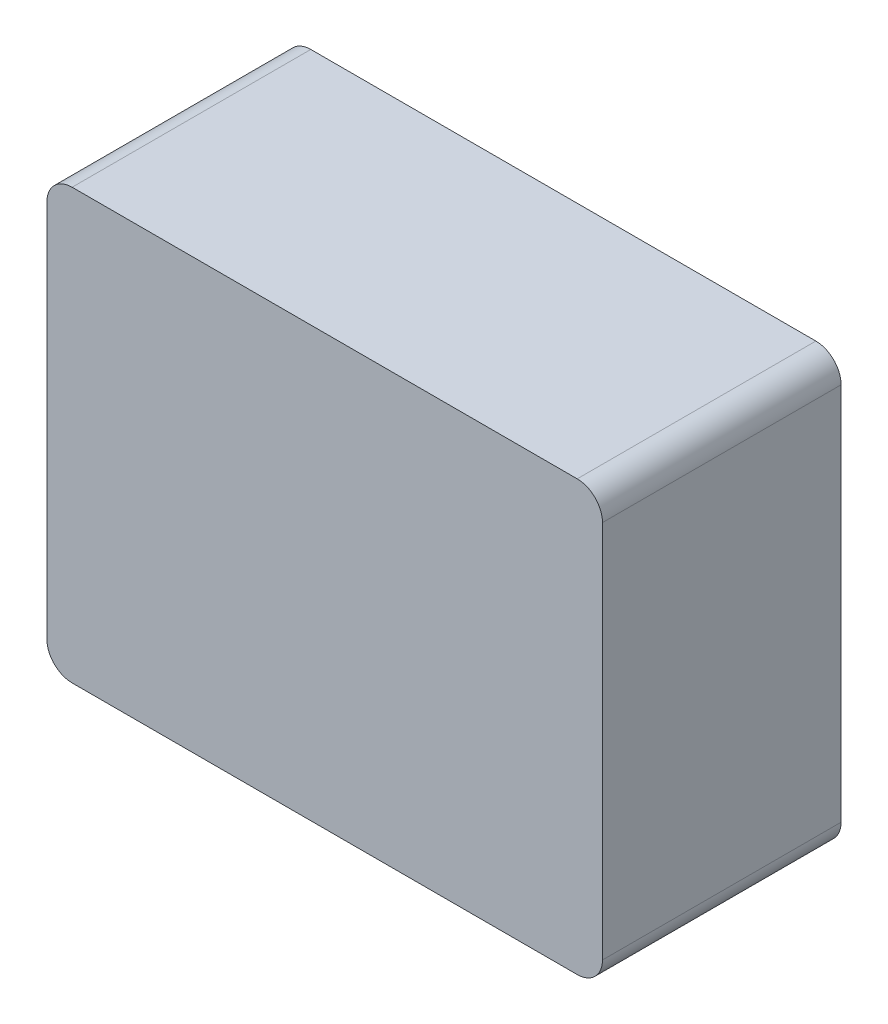
ISO-10303-21;
HEADER;
FILE_DESCRIPTION(('STEP AP214'),'2;1');
FILE_NAME('part.step','',(''),(''),'','','');
FILE_SCHEMA(('AUTOMOTIVE_DESIGN { 1 0 10303 214 1 1 1 1 }'));
ENDSEC;
DATA;
#1=APPLICATION_CONTEXT('core data for automotive mechanical design processes');
#2=APPLICATION_PROTOCOL_DEFINITION('international standard','automotive_design',2000,#1);
#3=PRODUCT_CONTEXT('',#1,'mechanical');
#4=PRODUCT('Part','Part','',(#3));
#5=PRODUCT_RELATED_PRODUCT_CATEGORY('part','',(#4));
#6=PRODUCT_DEFINITION_FORMATION('','',#4);
#7=PRODUCT_DEFINITION_CONTEXT('part definition',#1,'design');
#8=PRODUCT_DEFINITION('design','',#6,#7);
#9=PRODUCT_DEFINITION_SHAPE('','',#8);
#10=(LENGTH_UNIT() NAMED_UNIT(*) SI_UNIT(.MILLI.,.METRE.));
#11=(NAMED_UNIT(*) PLANE_ANGLE_UNIT() SI_UNIT($,.RADIAN.));
#12=(NAMED_UNIT(*) SI_UNIT($,.STERADIAN.) SOLID_ANGLE_UNIT());
#13=UNCERTAINTY_MEASURE_WITH_UNIT(LENGTH_MEASURE(1.E-05),#10,'distance_accuracy_value','');
#14=(GEOMETRIC_REPRESENTATION_CONTEXT(3) GLOBAL_UNCERTAINTY_ASSIGNED_CONTEXT((#13)) GLOBAL_UNIT_ASSIGNED_CONTEXT((#10,
#11,#12)) REPRESENTATION_CONTEXT('',''));
#15=CARTESIAN_POINT('',(0.,0.,0.));
#16=DIRECTION('',(0.,0.,1.));
#17=DIRECTION('',(1.,0.,0.));
#18=AXIS2_PLACEMENT_3D('',#15,#16,#17);
#19=CARTESIAN_POINT('',(0.,34.,0.));
#20=DIRECTION('',(-1.,0.,0.));
#21=DIRECTION('',(0.,0.,1.));
#22=AXIS2_PLACEMENT_3D('',#19,#20,#21);
#23=PLANE('',#22);
#24=DIRECTION('',(0.,-1.,0.));
#25=VECTOR('',#24,1.);
#26=CARTESIAN_POINT('',(0.,34.,-18.9));
#27=LINE('',#26,#25);
#28=CARTESIAN_POINT('',(0.,32.,-18.9));
#29=VERTEX_POINT('',#28);
#30=CARTESIAN_POINT('',(0.,2.,-18.9));
#31=VERTEX_POINT('',#30);
#32=EDGE_CURVE('E143',#29,#31,#27,.T.);
#33=ORIENTED_EDGE('',*,*,#32,.T.);
#34=DIRECTION('',(0.,0.,-1.));
#35=VECTOR('',#34,1.);
#36=CARTESIAN_POINT('',(0.,2.,0.));
#37=LINE('',#36,#35);
#38=CARTESIAN_POINT('',(0.,2.,0.));
#39=VERTEX_POINT('',#38);
#40=EDGE_CURVE('E103',#31,#39,#37,.F.);
#41=ORIENTED_EDGE('',*,*,#40,.T.);
#42=DIRECTION('',(0.,-1.,0.));
#43=VECTOR('',#42,1.);
#44=CARTESIAN_POINT('',(0.,34.,0.));
#45=LINE('',#44,#43);
#46=CARTESIAN_POINT('',(0.,32.,0.));
#47=VERTEX_POINT('',#46);
#48=EDGE_CURVE('E135',#47,#39,#45,.T.);
#49=ORIENTED_EDGE('',*,*,#48,.F.);
#50=DIRECTION('',(0.,0.,-1.));
#51=VECTOR('',#50,1.);
#52=CARTESIAN_POINT('',(0.,32.,-18.9));
#53=LINE('',#52,#51);
#54=EDGE_CURVE('E108',#47,#29,#53,.T.);
#55=ORIENTED_EDGE('',*,*,#54,.T.);
#56=EDGE_LOOP('',(#33,#41,#49,#55));
#57=FACE_BOUND('',#56,.T.);
#58=ADVANCED_FACE('F32',(#57),#23,.T.);
#59=CARTESIAN_POINT('',(0.,34.,0.));
#60=DIRECTION('',(0.,0.,-1.));
#61=DIRECTION('',(-1.,0.,0.));
#62=AXIS2_PLACEMENT_3D('',#59,#60,#61);
#63=PLANE('',#62);
#64=ORIENTED_EDGE('',*,*,#48,.T.);
#65=CARTESIAN_POINT('',(2.,2.,0.));
#66=DIRECTION('',(0.,0.,-1.));
#67=DIRECTION('',(-1.,0.,0.));
#68=AXIS2_PLACEMENT_3D('',#65,#66,#67);
#69=CIRCLE('',#68,2.);
#70=CARTESIAN_POINT('',(2.,0.,0.));
#71=VERTEX_POINT('',#70);
#72=EDGE_CURVE('E158',#39,#71,#69,.F.);
#73=ORIENTED_EDGE('',*,*,#72,.T.);
#74=DIRECTION('',(1.,0.,0.));
#75=VECTOR('',#74,1.);
#76=CARTESIAN_POINT('',(0.,0.,0.));
#77=LINE('',#76,#75);
#78=CARTESIAN_POINT('',(42.,0.,0.));
#79=VERTEX_POINT('',#78);
#80=EDGE_CURVE('E118',#71,#79,#77,.T.);
#81=ORIENTED_EDGE('',*,*,#80,.T.);
#82=CARTESIAN_POINT('',(42.,2.,0.));
#83=DIRECTION('',(0.,0.,-1.));
#84=DIRECTION('',(-1.,0.,0.));
#85=AXIS2_PLACEMENT_3D('',#82,#83,#84);
#86=CIRCLE('',#85,2.);
#87=CARTESIAN_POINT('',(44.,2.,0.));
#88=VERTEX_POINT('',#87);
#89=EDGE_CURVE('E156',#79,#88,#86,.F.);
#90=ORIENTED_EDGE('',*,*,#89,.T.);
#91=DIRECTION('',(0.,-1.,0.));
#92=VECTOR('',#91,1.);
#93=CARTESIAN_POINT('',(44.,34.,0.));
#94=LINE('',#93,#92);
#95=CARTESIAN_POINT('',(44.,32.,0.));
#96=VERTEX_POINT('',#95);
#97=EDGE_CURVE('E138',#96,#88,#94,.T.);
#98=ORIENTED_EDGE('',*,*,#97,.F.);
#99=CARTESIAN_POINT('',(42.,32.,0.));
#100=DIRECTION('',(0.,0.,-1.));
#101=DIRECTION('',(-1.,0.,0.));
#102=AXIS2_PLACEMENT_3D('',#99,#100,#101);
#103=CIRCLE('',#102,2.);
#104=CARTESIAN_POINT('',(42.,34.,0.));
#105=VERTEX_POINT('',#104);
#106=EDGE_CURVE('E47',#96,#105,#103,.F.);
#107=ORIENTED_EDGE('',*,*,#106,.T.);
#108=DIRECTION('',(1.,0.,0.));
#109=VECTOR('',#108,1.);
#110=CARTESIAN_POINT('',(0.,34.,0.));
#111=LINE('',#110,#109);
#112=CARTESIAN_POINT('',(2.,34.,0.));
#113=VERTEX_POINT('',#112);
#114=EDGE_CURVE('E132',#113,#105,#111,.T.);
#115=ORIENTED_EDGE('',*,*,#114,.F.);
#116=CARTESIAN_POINT('',(2.,32.,0.));
#117=DIRECTION('',(0.,0.,-1.));
#118=DIRECTION('',(-1.,0.,0.));
#119=AXIS2_PLACEMENT_3D('',#116,#117,#118);
#120=CIRCLE('',#119,2.);
#121=EDGE_CURVE('E153',#113,#47,#120,.F.);
#122=ORIENTED_EDGE('',*,*,#121,.T.);
#123=EDGE_LOOP('',(#64,#73,#81,#90,#98,#107,#115,#122));
#124=FACE_BOUND('',#123,.T.);
#125=ADVANCED_FACE('F233',(#124),#63,.F.);
#126=CARTESIAN_POINT('',(44.,34.,0.));
#127=DIRECTION('',(-1.,0.,0.));
#128=DIRECTION('',(0.,0.,1.));
#129=AXIS2_PLACEMENT_3D('',#126,#127,#128);
#130=PLANE('',#129);
#131=ORIENTED_EDGE('',*,*,#97,.T.);
#132=DIRECTION('',(0.,0.,-1.));
#133=VECTOR('',#132,1.);
#134=CARTESIAN_POINT('',(44.,2.,-18.9));
#135=LINE('',#134,#133);
#136=CARTESIAN_POINT('',(44.,2.,-18.9));
#137=VERTEX_POINT('',#136);
#138=EDGE_CURVE('E162',#88,#137,#135,.T.);
#139=ORIENTED_EDGE('',*,*,#138,.T.);
#140=DIRECTION('',(0.,-1.,0.));
#141=VECTOR('',#140,1.);
#142=CARTESIAN_POINT('',(44.,34.,-18.9));
#143=LINE('',#142,#141);
#144=CARTESIAN_POINT('',(44.,32.,-18.9));
#145=VERTEX_POINT('',#144);
#146=EDGE_CURVE('E141',#145,#137,#143,.T.);
#147=ORIENTED_EDGE('',*,*,#146,.F.);
#148=DIRECTION('',(0.,0.,-1.));
#149=VECTOR('',#148,1.);
#150=CARTESIAN_POINT('',(44.,32.,0.));
#151=LINE('',#150,#149);
#152=EDGE_CURVE('E160',#145,#96,#151,.F.);
#153=ORIENTED_EDGE('',*,*,#152,.T.);
#154=EDGE_LOOP('',(#131,#139,#147,#153));
#155=FACE_BOUND('',#154,.T.);
#156=ADVANCED_FACE('F167',(#155),#130,.F.);
#157=CARTESIAN_POINT('',(0.,34.,-18.9));
#158=DIRECTION('',(0.,0.,-1.));
#159=DIRECTION('',(-1.,0.,0.));
#160=AXIS2_PLACEMENT_3D('',#157,#158,#159);
#161=PLANE('',#160);
#162=DIRECTION('',(1.,0.,0.));
#163=VECTOR('',#162,1.);
#164=CARTESIAN_POINT('',(0.,0.,-18.9));
#165=LINE('',#164,#163);
#166=CARTESIAN_POINT('',(2.,0.,-18.9));
#167=VERTEX_POINT('',#166);
#168=CARTESIAN_POINT('',(42.,0.,-18.9));
#169=VERTEX_POINT('',#168);
#170=EDGE_CURVE('E115',#167,#169,#165,.T.);
#171=ORIENTED_EDGE('',*,*,#170,.F.);
#172=CARTESIAN_POINT('',(2.,2.,-18.9));
#173=DIRECTION('',(0.,0.,-1.));
#174=DIRECTION('',(-1.,0.,0.));
#175=AXIS2_PLACEMENT_3D('',#172,#173,#174);
#176=CIRCLE('',#175,2.);
#177=EDGE_CURVE('E98',#167,#31,#176,.T.);
#178=ORIENTED_EDGE('',*,*,#177,.T.);
#179=ORIENTED_EDGE('',*,*,#32,.F.);
#180=CARTESIAN_POINT('',(2.,32.,-18.9));
#181=DIRECTION('',(0.,0.,-1.));
#182=DIRECTION('',(-1.,0.,0.));
#183=AXIS2_PLACEMENT_3D('',#180,#181,#182);
#184=CIRCLE('',#183,2.);
#185=CARTESIAN_POINT('',(2.,34.,-18.9));
#186=VERTEX_POINT('',#185);
#187=EDGE_CURVE('E119',#29,#186,#184,.T.);
#188=ORIENTED_EDGE('',*,*,#187,.T.);
#189=DIRECTION('',(1.,0.,0.));
#190=VECTOR('',#189,1.);
#191=CARTESIAN_POINT('',(0.,34.,-18.9));
#192=LINE('',#191,#190);
#193=CARTESIAN_POINT('',(42.,34.,-18.9));
#194=VERTEX_POINT('',#193);
#195=EDGE_CURVE('E126',#186,#194,#192,.T.);
#196=ORIENTED_EDGE('',*,*,#195,.T.);
#197=CARTESIAN_POINT('',(42.,32.,-18.9));
#198=DIRECTION('',(0.,0.,-1.));
#199=DIRECTION('',(-1.,0.,0.));
#200=AXIS2_PLACEMENT_3D('',#197,#198,#199);
#201=CIRCLE('',#200,2.);
#202=EDGE_CURVE('E147',#194,#145,#201,.T.);
#203=ORIENTED_EDGE('',*,*,#202,.T.);
#204=ORIENTED_EDGE('',*,*,#146,.T.);
#205=CARTESIAN_POINT('',(42.,2.,-18.9));
#206=DIRECTION('',(0.,0.,-1.));
#207=DIRECTION('',(-1.,0.,0.));
#208=AXIS2_PLACEMENT_3D('',#205,#206,#207);
#209=CIRCLE('',#208,2.);
#210=EDGE_CURVE('E109',#137,#169,#209,.T.);
#211=ORIENTED_EDGE('',*,*,#210,.T.);
#212=EDGE_LOOP('',(#171,#178,#179,#188,#196,#203,#204,#211));
#213=FACE_BOUND('',#212,.T.);
#214=ADVANCED_FACE('F122',(#213),#161,.T.);
#215=CARTESIAN_POINT('',(0.,34.,0.));
#216=DIRECTION('',(0.,-1.,0.));
#217=DIRECTION('',(0.,0.,-1.));
#218=AXIS2_PLACEMENT_3D('',#215,#216,#217);
#219=PLANE('',#218);
#220=ORIENTED_EDGE('',*,*,#114,.T.);
#221=DIRECTION('',(0.,0.,-1.));
#222=VECTOR('',#221,1.);
#223=CARTESIAN_POINT('',(42.,34.,0.));
#224=LINE('',#223,#222);
#225=EDGE_CURVE('E11',#105,#194,#224,.T.);
#226=ORIENTED_EDGE('',*,*,#225,.T.);
#227=ORIENTED_EDGE('',*,*,#195,.F.);
#228=DIRECTION('',(0.,0.,-1.));
#229=VECTOR('',#228,1.);
#230=CARTESIAN_POINT('',(2.,34.,0.));
#231=LINE('',#230,#229);
#232=EDGE_CURVE('E40',#186,#113,#231,.F.);
#233=ORIENTED_EDGE('',*,*,#232,.T.);
#234=EDGE_LOOP('',(#220,#226,#227,#233));
#235=FACE_BOUND('',#234,.T.);
#236=ADVANCED_FACE('F175',(#235),#219,.F.);
#237=CARTESIAN_POINT('',(0.,0.,0.));
#238=DIRECTION('',(0.,-1.,0.));
#239=DIRECTION('',(0.,0.,-1.));
#240=AXIS2_PLACEMENT_3D('',#237,#238,#239);
#241=PLANE('',#240);
#242=CARTESIAN_POINT('',(33.,0.,-15.02));
#243=DIRECTION('',(0.,-1.,0.));
#244=DIRECTION('',(0.,0.,-1.));
#245=AXIS2_PLACEMENT_3D('',#242,#243,#244);
#246=CIRCLE('',#245,0.999999999999998);
#247=CARTESIAN_POINT('',(33.,0.,-16.02));
#248=VERTEX_POINT('',#247);
#249=EDGE_CURVE('E193',#248,#248,#246,.T.);
#250=ORIENTED_EDGE('',*,*,#249,.F.);
#251=EDGE_LOOP('',(#250));
#252=FACE_BOUND('',#251,.T.);
#253=CARTESIAN_POINT('',(11.,0.,-15.02));
#254=DIRECTION('',(0.,-1.,0.));
#255=DIRECTION('',(0.,0.,-1.));
#256=AXIS2_PLACEMENT_3D('',#253,#254,#255);
#257=CIRCLE('',#256,1.);
#258=CARTESIAN_POINT('',(11.,0.,-16.02));
#259=VERTEX_POINT('',#258);
#260=EDGE_CURVE('E187',#259,#259,#257,.T.);
#261=ORIENTED_EDGE('',*,*,#260,.F.);
#262=EDGE_LOOP('',(#261));
#263=FACE_BOUND('',#262,.T.);
#264=CARTESIAN_POINT('',(33.,0.,-3.02000000000002));
#265=DIRECTION('',(0.,-1.,0.));
#266=DIRECTION('',(0.,0.,-1.));
#267=AXIS2_PLACEMENT_3D('',#264,#265,#266);
#268=CIRCLE('',#267,0.999999999999998);
#269=CARTESIAN_POINT('',(33.,0.,-4.02000000000002));
#270=VERTEX_POINT('',#269);
#271=EDGE_CURVE('E181',#270,#270,#268,.T.);
#272=ORIENTED_EDGE('',*,*,#271,.F.);
#273=EDGE_LOOP('',(#272));
#274=FACE_BOUND('',#273,.T.);
#275=CARTESIAN_POINT('',(11.,0.,-3.02000000000003));
#276=DIRECTION('',(0.,-1.,0.));
#277=DIRECTION('',(0.,0.,-1.));
#278=AXIS2_PLACEMENT_3D('',#275,#276,#277);
#279=CIRCLE('',#278,1.);
#280=CARTESIAN_POINT('',(11.,0.,-4.02000000000003));
#281=VERTEX_POINT('',#280);
#282=EDGE_CURVE('E129',#281,#281,#279,.T.);
#283=ORIENTED_EDGE('',*,*,#282,.F.);
#284=EDGE_LOOP('',(#283));
#285=FACE_BOUND('',#284,.T.);
#286=ORIENTED_EDGE('',*,*,#80,.F.);
#287=DIRECTION('',(0.,0.,-1.));
#288=VECTOR('',#287,1.);
#289=CARTESIAN_POINT('',(2.,0.,0.));
#290=LINE('',#289,#288);
#291=EDGE_CURVE('E102',#71,#167,#290,.T.);
#292=ORIENTED_EDGE('',*,*,#291,.T.);
#293=ORIENTED_EDGE('',*,*,#170,.T.);
#294=DIRECTION('',(0.,0.,-1.));
#295=VECTOR('',#294,1.);
#296=CARTESIAN_POINT('',(42.,0.,0.));
#297=LINE('',#296,#295);
#298=EDGE_CURVE('E120',#169,#79,#297,.F.);
#299=ORIENTED_EDGE('',*,*,#298,.T.);
#300=EDGE_LOOP('',(#286,#292,#293,#299));
#301=FACE_BOUND('',#300,.T.);
#302=ADVANCED_FACE('F114',(#252,#263,#274,#285,#301),#241,.T.);
#303=CARTESIAN_POINT('',(2.,2.,0.));
#304=DIRECTION('',(0.,0.,-1.));
#305=DIRECTION('',(-1.,0.,0.));
#306=AXIS2_PLACEMENT_3D('',#303,#304,#305);
#307=CYLINDRICAL_SURFACE('',#306,2.);
#308=ORIENTED_EDGE('',*,*,#72,.F.);
#309=ORIENTED_EDGE('',*,*,#40,.F.);
#310=ORIENTED_EDGE('',*,*,#177,.F.);
#311=ORIENTED_EDGE('',*,*,#291,.F.);
#312=EDGE_LOOP('',(#308,#309,#310,#311));
#313=FACE_BOUND('',#312,.T.);
#314=ADVANCED_FACE('F101',(#313),#307,.T.);
#315=CARTESIAN_POINT('',(42.,2.,0.));
#316=DIRECTION('',(0.,0.,1.));
#317=DIRECTION('',(1.,0.,0.));
#318=AXIS2_PLACEMENT_3D('',#315,#316,#317);
#319=CYLINDRICAL_SURFACE('',#318,2.);
#320=ORIENTED_EDGE('',*,*,#89,.F.);
#321=ORIENTED_EDGE('',*,*,#298,.F.);
#322=ORIENTED_EDGE('',*,*,#210,.F.);
#323=ORIENTED_EDGE('',*,*,#138,.F.);
#324=EDGE_LOOP('',(#320,#321,#322,#323));
#325=FACE_BOUND('',#324,.T.);
#326=ADVANCED_FACE('F245',(#325),#319,.T.);
#327=CARTESIAN_POINT('',(42.,32.,0.));
#328=DIRECTION('',(0.,0.,-1.));
#329=DIRECTION('',(-1.,0.,0.));
#330=AXIS2_PLACEMENT_3D('',#327,#328,#329);
#331=CYLINDRICAL_SURFACE('',#330,2.);
#332=ORIENTED_EDGE('',*,*,#106,.F.);
#333=ORIENTED_EDGE('',*,*,#152,.F.);
#334=ORIENTED_EDGE('',*,*,#202,.F.);
#335=ORIENTED_EDGE('',*,*,#225,.F.);
#336=EDGE_LOOP('',(#332,#333,#334,#335));
#337=FACE_BOUND('',#336,.T.);
#338=ADVANCED_FACE('F174',(#337),#331,.T.);
#339=CARTESIAN_POINT('',(2.,32.,0.));
#340=DIRECTION('',(0.,0.,1.));
#341=DIRECTION('',(1.,0.,0.));
#342=AXIS2_PLACEMENT_3D('',#339,#340,#341);
#343=CYLINDRICAL_SURFACE('',#342,2.);
#344=ORIENTED_EDGE('',*,*,#121,.F.);
#345=ORIENTED_EDGE('',*,*,#232,.F.);
#346=ORIENTED_EDGE('',*,*,#187,.F.);
#347=ORIENTED_EDGE('',*,*,#54,.F.);
#348=EDGE_LOOP('',(#344,#345,#346,#347));
#349=FACE_BOUND('',#348,.T.);
#350=ADVANCED_FACE('F34',(#349),#343,.T.);
#351=CARTESIAN_POINT('',(11.,3.5,-3.02000000000003));
#352=DIRECTION('',(0.,-1.,0.));
#353=DIRECTION('',(0.,0.,-1.));
#354=AXIS2_PLACEMENT_3D('',#351,#352,#353);
#355=CYLINDRICAL_SURFACE('',#354,1.);
#356=CARTESIAN_POINT('',(11.,3.5,-3.02000000000003));
#357=DIRECTION('',(0.,-1.,0.));
#358=DIRECTION('',(0.,0.,-1.));
#359=AXIS2_PLACEMENT_3D('',#356,#357,#358);
#360=CIRCLE('',#359,1.);
#361=CARTESIAN_POINT('',(11.,3.5,-4.02000000000003));
#362=VERTEX_POINT('',#361);
#363=EDGE_CURVE('E124',#362,#362,#360,.T.);
#364=ORIENTED_EDGE('',*,*,#363,.F.);
#365=EDGE_LOOP('',(#364));
#366=FACE_BOUND('',#365,.T.);
#367=ORIENTED_EDGE('',*,*,#282,.T.);
#368=EDGE_LOOP('',(#367));
#369=FACE_BOUND('',#368,.T.);
#370=ADVANCED_FACE('F217',(#366,#369),#355,.F.);
#371=CARTESIAN_POINT('',(11.,3.5,-3.02000000000003));
#372=DIRECTION('',(0.,-1.,0.));
#373=DIRECTION('',(0.,0.,-1.));
#374=AXIS2_PLACEMENT_3D('',#371,#372,#373);
#375=PLANE('',#374);
#376=ORIENTED_EDGE('',*,*,#363,.T.);
#377=EDGE_LOOP('',(#376));
#378=FACE_BOUND('',#377,.T.);
#379=ADVANCED_FACE('F219',(#378),#375,.T.);
#380=CARTESIAN_POINT('',(33.,3.5,-3.02000000000002));
#381=DIRECTION('',(0.,-1.,0.));
#382=DIRECTION('',(0.,0.,-1.));
#383=AXIS2_PLACEMENT_3D('',#380,#381,#382);
#384=CYLINDRICAL_SURFACE('',#383,0.999999999999998);
#385=CARTESIAN_POINT('',(33.,3.5,-3.02000000000002));
#386=DIRECTION('',(0.,-1.,0.));
#387=DIRECTION('',(0.,0.,-1.));
#388=AXIS2_PLACEMENT_3D('',#385,#386,#387);
#389=CIRCLE('',#388,0.999999999999998);
#390=CARTESIAN_POINT('',(33.,3.5,-4.02000000000002));
#391=VERTEX_POINT('',#390);
#392=EDGE_CURVE('E179',#391,#391,#389,.T.);
#393=ORIENTED_EDGE('',*,*,#392,.F.);
#394=EDGE_LOOP('',(#393));
#395=FACE_BOUND('',#394,.T.);
#396=ORIENTED_EDGE('',*,*,#271,.T.);
#397=EDGE_LOOP('',(#396));
#398=FACE_BOUND('',#397,.T.);
#399=ADVANCED_FACE('F226',(#395,#398),#384,.F.);
#400=CARTESIAN_POINT('',(33.,3.5,-3.02000000000002));
#401=DIRECTION('',(0.,-1.,0.));
#402=DIRECTION('',(0.,0.,-1.));
#403=AXIS2_PLACEMENT_3D('',#400,#401,#402);
#404=PLANE('',#403);
#405=ORIENTED_EDGE('',*,*,#392,.T.);
#406=EDGE_LOOP('',(#405));
#407=FACE_BOUND('',#406,.T.);
#408=ADVANCED_FACE('F284',(#407),#404,.T.);
#409=CARTESIAN_POINT('',(11.,3.5,-15.02));
#410=DIRECTION('',(0.,-1.,0.));
#411=DIRECTION('',(0.,0.,-1.));
#412=AXIS2_PLACEMENT_3D('',#409,#410,#411);
#413=CYLINDRICAL_SURFACE('',#412,1.);
#414=CARTESIAN_POINT('',(11.,3.5,-15.02));
#415=DIRECTION('',(0.,-1.,0.));
#416=DIRECTION('',(0.,0.,-1.));
#417=AXIS2_PLACEMENT_3D('',#414,#415,#416);
#418=CIRCLE('',#417,1.);
#419=CARTESIAN_POINT('',(11.,3.5,-16.02));
#420=VERTEX_POINT('',#419);
#421=EDGE_CURVE('E184',#420,#420,#418,.T.);
#422=ORIENTED_EDGE('',*,*,#421,.F.);
#423=EDGE_LOOP('',(#422));
#424=FACE_BOUND('',#423,.T.);
#425=ORIENTED_EDGE('',*,*,#260,.T.);
#426=EDGE_LOOP('',(#425));
#427=FACE_BOUND('',#426,.T.);
#428=ADVANCED_FACE('F294',(#424,#427),#413,.F.);
#429=CARTESIAN_POINT('',(11.,3.5,-15.02));
#430=DIRECTION('',(0.,-1.,0.));
#431=DIRECTION('',(0.,0.,-1.));
#432=AXIS2_PLACEMENT_3D('',#429,#430,#431);
#433=PLANE('',#432);
#434=ORIENTED_EDGE('',*,*,#421,.T.);
#435=EDGE_LOOP('',(#434));
#436=FACE_BOUND('',#435,.T.);
#437=ADVANCED_FACE('F204',(#436),#433,.T.);
#438=CARTESIAN_POINT('',(33.,3.5,-15.02));
#439=DIRECTION('',(0.,-1.,0.));
#440=DIRECTION('',(0.,0.,-1.));
#441=AXIS2_PLACEMENT_3D('',#438,#439,#440);
#442=CYLINDRICAL_SURFACE('',#441,0.999999999999998);
#443=CARTESIAN_POINT('',(33.,3.5,-15.02));
#444=DIRECTION('',(0.,-1.,0.));
#445=DIRECTION('',(0.,0.,-1.));
#446=AXIS2_PLACEMENT_3D('',#443,#444,#445);
#447=CIRCLE('',#446,0.999999999999998);
#448=CARTESIAN_POINT('',(33.,3.5,-16.02));
#449=VERTEX_POINT('',#448);
#450=EDGE_CURVE('E190',#449,#449,#447,.T.);
#451=ORIENTED_EDGE('',*,*,#450,.F.);
#452=EDGE_LOOP('',(#451));
#453=FACE_BOUND('',#452,.T.);
#454=ORIENTED_EDGE('',*,*,#249,.T.);
#455=EDGE_LOOP('',(#454));
#456=FACE_BOUND('',#455,.T.);
#457=ADVANCED_FACE('F201',(#453,#456),#442,.F.);
#458=CARTESIAN_POINT('',(33.,3.5,-15.02));
#459=DIRECTION('',(0.,-1.,0.));
#460=DIRECTION('',(0.,0.,-1.));
#461=AXIS2_PLACEMENT_3D('',#458,#459,#460);
#462=PLANE('',#461);
#463=ORIENTED_EDGE('',*,*,#450,.T.);
#464=EDGE_LOOP('',(#463));
#465=FACE_BOUND('',#464,.T.);
#466=ADVANCED_FACE('F199',(#465),#462,.T.);
#467=CLOSED_SHELL('',(#58,#125,#156,#214,#236,#302,#314,#326,#338,#350,#370,#379,#399,#408,#428,
#437,#457,#466));
#468=MANIFOLD_SOLID_BREP('B2',#467);
#469=ADVANCED_BREP_SHAPE_REPRESENTATION('',(#18,#468),#14);
#470=SHAPE_DEFINITION_REPRESENTATION(#9,#469);
ENDSEC;
END-ISO-10303-21;
